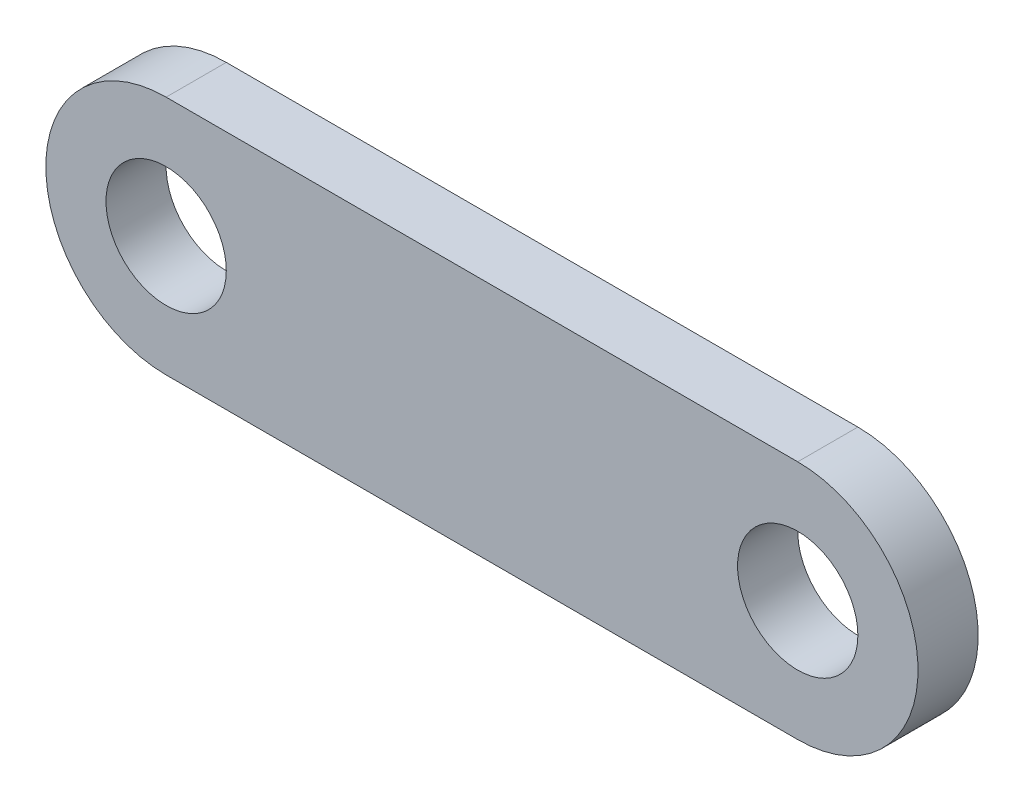
ISO-10303-21;
HEADER;
FILE_DESCRIPTION(('STEP AP214'),'2;1');
FILE_NAME('part.step','',(''),(''),'','','');
FILE_SCHEMA(('AUTOMOTIVE_DESIGN { 1 0 10303 214 1 1 1 1 }'));
ENDSEC;
DATA;
#1=APPLICATION_CONTEXT('core data for automotive mechanical design processes');
#2=APPLICATION_PROTOCOL_DEFINITION('international standard','automotive_design',2000,#1);
#3=PRODUCT_CONTEXT('',#1,'mechanical');
#4=PRODUCT('Part','Part','',(#3));
#5=PRODUCT_RELATED_PRODUCT_CATEGORY('part','',(#4));
#6=PRODUCT_DEFINITION_FORMATION('','',#4);
#7=PRODUCT_DEFINITION_CONTEXT('part definition',#1,'design');
#8=PRODUCT_DEFINITION('design','',#6,#7);
#9=PRODUCT_DEFINITION_SHAPE('','',#8);
#10=(LENGTH_UNIT() NAMED_UNIT(*) SI_UNIT(.MILLI.,.METRE.));
#11=(NAMED_UNIT(*) PLANE_ANGLE_UNIT() SI_UNIT($,.RADIAN.));
#12=(NAMED_UNIT(*) SI_UNIT($,.STERADIAN.) SOLID_ANGLE_UNIT());
#13=UNCERTAINTY_MEASURE_WITH_UNIT(LENGTH_MEASURE(1.E-05),#10,'distance_accuracy_value','');
#14=(GEOMETRIC_REPRESENTATION_CONTEXT(3) GLOBAL_UNCERTAINTY_ASSIGNED_CONTEXT((#13)) GLOBAL_UNIT_ASSIGNED_CONTEXT((#10,
#11,#12)) REPRESENTATION_CONTEXT('',''));
#15=CARTESIAN_POINT('',(0.,0.,0.));
#16=DIRECTION('',(0.,0.,1.));
#17=DIRECTION('',(1.,0.,0.));
#18=AXIS2_PLACEMENT_3D('',#15,#16,#17);
#19=CARTESIAN_POINT('',(0.,0.,2.54));
#20=DIRECTION('',(0.,0.,1.));
#21=DIRECTION('',(1.,0.,0.));
#22=AXIS2_PLACEMENT_3D('',#19,#20,#21);
#23=PLANE('',#22);
#24=CARTESIAN_POINT('',(0.,0.,2.54));
#25=DIRECTION('',(0.,0.,1.));
#26=DIRECTION('',(1.,0.,0.));
#27=AXIS2_PLACEMENT_3D('',#24,#25,#26);
#28=CIRCLE('',#27,2.54);
#29=CARTESIAN_POINT('',(2.54,0.,2.54));
#30=VERTEX_POINT('',#29);
#31=EDGE_CURVE('E101',#30,#30,#28,.T.);
#32=ORIENTED_EDGE('',*,*,#31,.F.);
#33=EDGE_LOOP('',(#32));
#34=FACE_BOUND('',#33,.T.);
#35=CARTESIAN_POINT('',(0.,0.,2.54));
#36=DIRECTION('',(0.,0.,1.));
#37=DIRECTION('',(1.,0.,0.));
#38=AXIS2_PLACEMENT_3D('',#35,#36,#37);
#39=CIRCLE('',#38,5.08);
#40=CARTESIAN_POINT('',(0.,-5.08,2.54));
#41=VERTEX_POINT('',#40);
#42=CARTESIAN_POINT('',(0.,5.08,2.54));
#43=VERTEX_POINT('',#42);
#44=EDGE_CURVE('E86',#41,#43,#39,.T.);
#45=ORIENTED_EDGE('',*,*,#44,.T.);
#46=DIRECTION('',(-1.,0.,0.));
#47=VECTOR('',#46,1.);
#48=CARTESIAN_POINT('',(0.,5.08,2.54));
#49=LINE('',#48,#47);
#50=CARTESIAN_POINT('',(-26.67,5.08,2.54));
#51=VERTEX_POINT('',#50);
#52=EDGE_CURVE('E81',#43,#51,#49,.T.);
#53=ORIENTED_EDGE('',*,*,#52,.T.);
#54=CARTESIAN_POINT('',(-26.67,0.,2.54));
#55=DIRECTION('',(0.,0.,1.));
#56=DIRECTION('',(1.,0.,0.));
#57=AXIS2_PLACEMENT_3D('',#54,#55,#56);
#58=CIRCLE('',#57,5.08);
#59=CARTESIAN_POINT('',(-26.67,-5.08,2.54));
#60=VERTEX_POINT('',#59);
#61=EDGE_CURVE('E84',#51,#60,#58,.T.);
#62=ORIENTED_EDGE('',*,*,#61,.T.);
#63=DIRECTION('',(1.,0.,0.));
#64=VECTOR('',#63,1.);
#65=CARTESIAN_POINT('',(0.,-5.08,2.54));
#66=LINE('',#65,#64);
#67=EDGE_CURVE('E51',#60,#41,#66,.T.);
#68=ORIENTED_EDGE('',*,*,#67,.T.);
#69=EDGE_LOOP('',(#45,#53,#62,#68));
#70=FACE_BOUND('',#69,.T.);
#71=CARTESIAN_POINT('',(-26.67,0.,2.54));
#72=DIRECTION('',(0.,0.,1.));
#73=DIRECTION('',(1.,0.,0.));
#74=AXIS2_PLACEMENT_3D('',#71,#72,#73);
#75=CIRCLE('',#74,2.54);
#76=CARTESIAN_POINT('',(-24.13,0.,2.54));
#77=VERTEX_POINT('',#76);
#78=EDGE_CURVE('E116',#77,#77,#75,.T.);
#79=ORIENTED_EDGE('',*,*,#78,.F.);
#80=EDGE_LOOP('',(#79));
#81=FACE_BOUND('',#80,.T.);
#82=ADVANCED_FACE('F34',(#34,#70,#81),#23,.T.);
#83=CARTESIAN_POINT('',(0.,0.,0.));
#84=DIRECTION('',(0.,0.,1.));
#85=DIRECTION('',(1.,0.,0.));
#86=AXIS2_PLACEMENT_3D('',#83,#84,#85);
#87=PLANE('',#86);
#88=CARTESIAN_POINT('',(0.,0.,0.));
#89=DIRECTION('',(0.,0.,1.));
#90=DIRECTION('',(1.,0.,0.));
#91=AXIS2_PLACEMENT_3D('',#88,#89,#90);
#92=CIRCLE('',#91,5.08);
#93=CARTESIAN_POINT('',(0.,-5.08,0.));
#94=VERTEX_POINT('',#93);
#95=CARTESIAN_POINT('',(0.,5.08,0.));
#96=VERTEX_POINT('',#95);
#97=EDGE_CURVE('E98',#94,#96,#92,.T.);
#98=ORIENTED_EDGE('',*,*,#97,.F.);
#99=DIRECTION('',(1.,0.,0.));
#100=VECTOR('',#99,1.);
#101=CARTESIAN_POINT('',(0.,-5.08,0.));
#102=LINE('',#101,#100);
#103=CARTESIAN_POINT('',(-26.67,-5.08,0.));
#104=VERTEX_POINT('',#103);
#105=EDGE_CURVE('E74',#104,#94,#102,.T.);
#106=ORIENTED_EDGE('',*,*,#105,.F.);
#107=CARTESIAN_POINT('',(-26.67,0.,0.));
#108=DIRECTION('',(0.,0.,1.));
#109=DIRECTION('',(1.,0.,0.));
#110=AXIS2_PLACEMENT_3D('',#107,#108,#109);
#111=CIRCLE('',#110,5.08);
#112=CARTESIAN_POINT('',(-26.67,5.08,0.));
#113=VERTEX_POINT('',#112);
#114=EDGE_CURVE('E68',#113,#104,#111,.T.);
#115=ORIENTED_EDGE('',*,*,#114,.F.);
#116=DIRECTION('',(-1.,0.,0.));
#117=VECTOR('',#116,1.);
#118=CARTESIAN_POINT('',(0.,5.08,0.));
#119=LINE('',#118,#117);
#120=EDGE_CURVE('E90',#96,#113,#119,.T.);
#121=ORIENTED_EDGE('',*,*,#120,.F.);
#122=EDGE_LOOP('',(#98,#106,#115,#121));
#123=FACE_BOUND('',#122,.T.);
#124=CARTESIAN_POINT('',(0.,0.,0.));
#125=DIRECTION('',(0.,0.,1.));
#126=DIRECTION('',(1.,0.,0.));
#127=AXIS2_PLACEMENT_3D('',#124,#125,#126);
#128=CIRCLE('',#127,2.54);
#129=CARTESIAN_POINT('',(2.54,0.,0.));
#130=VERTEX_POINT('',#129);
#131=EDGE_CURVE('E113',#130,#130,#128,.T.);
#132=ORIENTED_EDGE('',*,*,#131,.T.);
#133=EDGE_LOOP('',(#132));
#134=FACE_BOUND('',#133,.T.);
#135=CARTESIAN_POINT('',(-26.67,0.,0.));
#136=DIRECTION('',(0.,0.,1.));
#137=DIRECTION('',(1.,0.,0.));
#138=AXIS2_PLACEMENT_3D('',#135,#136,#137);
#139=CIRCLE('',#138,2.54);
#140=CARTESIAN_POINT('',(-24.13,0.,0.));
#141=VERTEX_POINT('',#140);
#142=EDGE_CURVE('E119',#141,#141,#139,.T.);
#143=ORIENTED_EDGE('',*,*,#142,.T.);
#144=EDGE_LOOP('',(#143));
#145=FACE_BOUND('',#144,.T.);
#146=ADVANCED_FACE('F109',(#123,#134,#145),#87,.F.);
#147=CARTESIAN_POINT('',(0.,0.,2.54));
#148=DIRECTION('',(0.,0.,-1.));
#149=DIRECTION('',(-1.,0.,0.));
#150=AXIS2_PLACEMENT_3D('',#147,#148,#149);
#151=CYLINDRICAL_SURFACE('',#150,5.08);
#152=ORIENTED_EDGE('',*,*,#97,.T.);
#153=DIRECTION('',(0.,0.,-1.));
#154=VECTOR('',#153,1.);
#155=CARTESIAN_POINT('',(0.,5.08,2.54));
#156=LINE('',#155,#154);
#157=EDGE_CURVE('E11',#43,#96,#156,.T.);
#158=ORIENTED_EDGE('',*,*,#157,.F.);
#159=ORIENTED_EDGE('',*,*,#44,.F.);
#160=DIRECTION('',(0.,0.,-1.));
#161=VECTOR('',#160,1.);
#162=CARTESIAN_POINT('',(0.,-5.08,2.54));
#163=LINE('',#162,#161);
#164=EDGE_CURVE('E94',#41,#94,#163,.T.);
#165=ORIENTED_EDGE('',*,*,#164,.T.);
#166=EDGE_LOOP('',(#152,#158,#159,#165));
#167=FACE_BOUND('',#166,.T.);
#168=ADVANCED_FACE('F36',(#167),#151,.T.);
#169=CARTESIAN_POINT('',(0.,5.08,2.54));
#170=DIRECTION('',(0.,-1.,0.));
#171=DIRECTION('',(1.,0.,0.));
#172=AXIS2_PLACEMENT_3D('',#169,#170,#171);
#173=PLANE('',#172);
#174=ORIENTED_EDGE('',*,*,#120,.T.);
#175=DIRECTION('',(0.,0.,-1.));
#176=VECTOR('',#175,1.);
#177=CARTESIAN_POINT('',(-26.67,5.08,2.54));
#178=LINE('',#177,#176);
#179=EDGE_CURVE('E43',#51,#113,#178,.T.);
#180=ORIENTED_EDGE('',*,*,#179,.F.);
#181=ORIENTED_EDGE('',*,*,#52,.F.);
#182=ORIENTED_EDGE('',*,*,#157,.T.);
#183=EDGE_LOOP('',(#174,#180,#181,#182));
#184=FACE_BOUND('',#183,.T.);
#185=ADVANCED_FACE('F89',(#184),#173,.F.);
#186=CARTESIAN_POINT('',(-26.67,0.,2.54));
#187=DIRECTION('',(0.,0.,-1.));
#188=DIRECTION('',(-1.,0.,0.));
#189=AXIS2_PLACEMENT_3D('',#186,#187,#188);
#190=CYLINDRICAL_SURFACE('',#189,5.08);
#191=ORIENTED_EDGE('',*,*,#114,.T.);
#192=DIRECTION('',(0.,0.,-1.));
#193=VECTOR('',#192,1.);
#194=CARTESIAN_POINT('',(-26.67,-5.08,2.54));
#195=LINE('',#194,#193);
#196=EDGE_CURVE('E91',#60,#104,#195,.T.);
#197=ORIENTED_EDGE('',*,*,#196,.F.);
#198=ORIENTED_EDGE('',*,*,#61,.F.);
#199=ORIENTED_EDGE('',*,*,#179,.T.);
#200=EDGE_LOOP('',(#191,#197,#198,#199));
#201=FACE_BOUND('',#200,.T.);
#202=ADVANCED_FACE('F92',(#201),#190,.T.);
#203=CARTESIAN_POINT('',(0.,-5.08,2.54));
#204=DIRECTION('',(0.,1.,0.));
#205=DIRECTION('',(-1.,0.,0.));
#206=AXIS2_PLACEMENT_3D('',#203,#204,#205);
#207=PLANE('',#206);
#208=ORIENTED_EDGE('',*,*,#105,.T.);
#209=ORIENTED_EDGE('',*,*,#164,.F.);
#210=ORIENTED_EDGE('',*,*,#67,.F.);
#211=ORIENTED_EDGE('',*,*,#196,.T.);
#212=EDGE_LOOP('',(#208,#209,#210,#211));
#213=FACE_BOUND('',#212,.T.);
#214=ADVANCED_FACE('F106',(#213),#207,.F.);
#215=CARTESIAN_POINT('',(0.,0.,2.54));
#216=DIRECTION('',(0.,0.,-1.));
#217=DIRECTION('',(-1.,0.,0.));
#218=AXIS2_PLACEMENT_3D('',#215,#216,#217);
#219=CYLINDRICAL_SURFACE('',#218,2.54);
#220=ORIENTED_EDGE('',*,*,#31,.T.);
#221=EDGE_LOOP('',(#220));
#222=FACE_BOUND('',#221,.T.);
#223=ORIENTED_EDGE('',*,*,#131,.F.);
#224=EDGE_LOOP('',(#223));
#225=FACE_BOUND('',#224,.T.);
#226=ADVANCED_FACE('F136',(#222,#225),#219,.F.);
#227=CARTESIAN_POINT('',(-26.67,0.,2.54));
#228=DIRECTION('',(0.,0.,-1.));
#229=DIRECTION('',(-1.,0.,0.));
#230=AXIS2_PLACEMENT_3D('',#227,#228,#229);
#231=CYLINDRICAL_SURFACE('',#230,2.54);
#232=ORIENTED_EDGE('',*,*,#78,.T.);
#233=EDGE_LOOP('',(#232));
#234=FACE_BOUND('',#233,.T.);
#235=ORIENTED_EDGE('',*,*,#142,.F.);
#236=EDGE_LOOP('',(#235));
#237=FACE_BOUND('',#236,.T.);
#238=ADVANCED_FACE('F125',(#234,#237),#231,.F.);
#239=CLOSED_SHELL('',(#82,#146,#168,#185,#202,#214,#226,#238));
#240=MANIFOLD_SOLID_BREP('B2',#239);
#241=ADVANCED_BREP_SHAPE_REPRESENTATION('',(#18,#240),#14);
#242=SHAPE_DEFINITION_REPRESENTATION(#9,#241);
ENDSEC;
END-ISO-10303-21;
